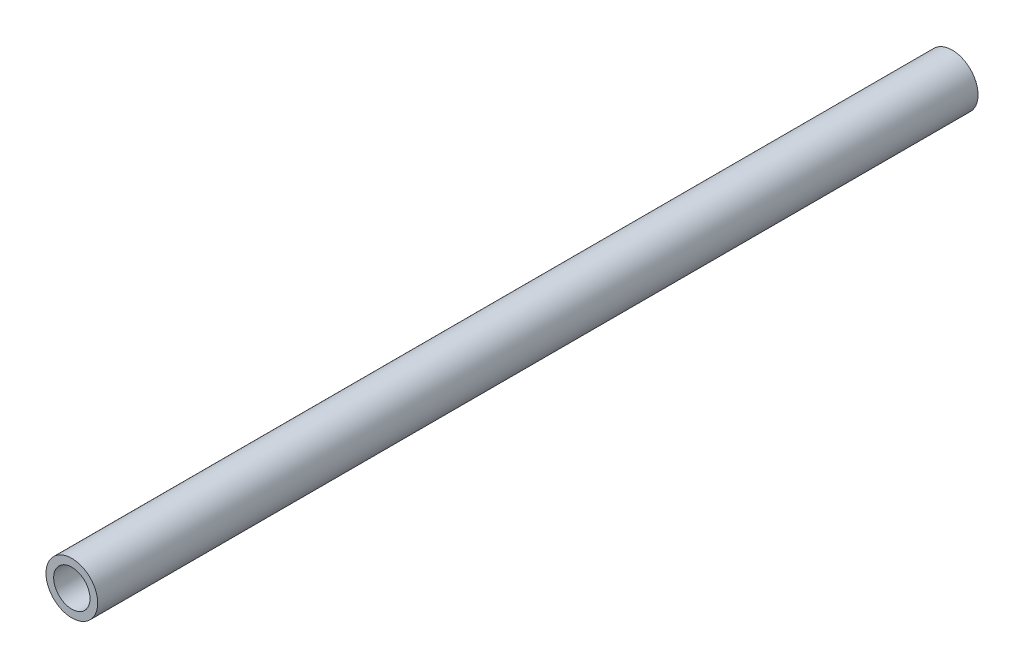
ISO-10303-21;
HEADER;
FILE_DESCRIPTION(('STEP AP214'),'2;1');
FILE_NAME('part.step','',(''),(''),'','','');
FILE_SCHEMA(('AUTOMOTIVE_DESIGN { 1 0 10303 214 1 1 1 1 }'));
ENDSEC;
DATA;
#1=APPLICATION_CONTEXT('core data for automotive mechanical design processes');
#2=APPLICATION_PROTOCOL_DEFINITION('international standard','automotive_design',2000,#1);
#3=PRODUCT_CONTEXT('',#1,'mechanical');
#4=PRODUCT('Part','Part','',(#3));
#5=PRODUCT_RELATED_PRODUCT_CATEGORY('part','',(#4));
#6=PRODUCT_DEFINITION_FORMATION('','',#4);
#7=PRODUCT_DEFINITION_CONTEXT('part definition',#1,'design');
#8=PRODUCT_DEFINITION('design','',#6,#7);
#9=PRODUCT_DEFINITION_SHAPE('','',#8);
#10=(LENGTH_UNIT() NAMED_UNIT(*) SI_UNIT(.MILLI.,.METRE.));
#11=(NAMED_UNIT(*) PLANE_ANGLE_UNIT() SI_UNIT($,.RADIAN.));
#12=(NAMED_UNIT(*) SI_UNIT($,.STERADIAN.) SOLID_ANGLE_UNIT());
#13=UNCERTAINTY_MEASURE_WITH_UNIT(LENGTH_MEASURE(1.E-05),#10,'distance_accuracy_value','');
#14=(GEOMETRIC_REPRESENTATION_CONTEXT(3) GLOBAL_UNCERTAINTY_ASSIGNED_CONTEXT((#13)) GLOBAL_UNIT_ASSIGNED_CONTEXT((#10,
#11,#12)) REPRESENTATION_CONTEXT('',''));
#15=CARTESIAN_POINT('',(0.,0.,0.));
#16=DIRECTION('',(0.,0.,1.));
#17=DIRECTION('',(1.,0.,0.));
#18=AXIS2_PLACEMENT_3D('',#15,#16,#17);
#19=CARTESIAN_POINT('',(347.5,-19.9999999999998,498.183766184074));
#20=DIRECTION('',(0.,0.,-1.));
#21=DIRECTION('',(-1.,0.,0.));
#22=AXIS2_PLACEMENT_3D('',#19,#20,#21);
#23=CYLINDRICAL_SURFACE('',#22,9.50000000000001);
#24=CARTESIAN_POINT('',(347.5,-19.9999999999998,0.));
#25=DIRECTION('',(0.,0.,-1.));
#26=DIRECTION('',(-1.,0.,0.));
#27=AXIS2_PLACEMENT_3D('',#24,#25,#26);
#28=CIRCLE('',#27,9.50000000000001);
#29=CARTESIAN_POINT('',(338.,-19.9999999999998,0.));
#30=VERTEX_POINT('',#29);
#31=EDGE_CURVE('E26',#30,#30,#28,.T.);
#32=ORIENTED_EDGE('',*,*,#31,.T.);
#33=EDGE_LOOP('',(#32));
#34=FACE_BOUND('',#33,.T.);
#35=CARTESIAN_POINT('',(347.5,-19.9999999999998,460.));
#36=DIRECTION('',(0.,0.,-1.));
#37=DIRECTION('',(-1.,0.,0.));
#38=AXIS2_PLACEMENT_3D('',#35,#36,#37);
#39=CIRCLE('',#38,9.50000000000001);
#40=CARTESIAN_POINT('',(338.,-19.9999999999998,460.));
#41=VERTEX_POINT('',#40);
#42=EDGE_CURVE('E17',#41,#41,#39,.T.);
#43=ORIENTED_EDGE('',*,*,#42,.F.);
#44=EDGE_LOOP('',(#43));
#45=FACE_BOUND('',#44,.T.);
#46=ADVANCED_FACE('F14',(#34,#45),#23,.F.);
#47=CARTESIAN_POINT('',(0.,-40.,460.));
#48=DIRECTION('',(0.,0.,1.));
#49=DIRECTION('',(1.,0.,0.));
#50=AXIS2_PLACEMENT_3D('',#47,#48,#49);
#51=PLANE('',#50);
#52=CARTESIAN_POINT('',(347.5,-19.9999999999998,460.));
#53=DIRECTION('',(0.,0.,-1.));
#54=DIRECTION('',(-1.,0.,0.));
#55=AXIS2_PLACEMENT_3D('',#52,#53,#54);
#56=CIRCLE('',#55,13.5);
#57=CARTESIAN_POINT('',(334.,-19.9999999999998,460.));
#58=VERTEX_POINT('',#57);
#59=EDGE_CURVE('E21',#58,#58,#56,.T.);
#60=ORIENTED_EDGE('',*,*,#59,.F.);
#61=EDGE_LOOP('',(#60));
#62=FACE_BOUND('',#61,.T.);
#63=ORIENTED_EDGE('',*,*,#42,.T.);
#64=EDGE_LOOP('',(#63));
#65=FACE_BOUND('',#64,.T.);
#66=ADVANCED_FACE('F34',(#62,#65),#51,.T.);
#67=CARTESIAN_POINT('',(347.5,-19.9999999999998,0.));
#68=DIRECTION('',(0.,0.,1.));
#69=DIRECTION('',(1.,0.,0.));
#70=AXIS2_PLACEMENT_3D('',#67,#68,#69);
#71=PLANE('',#70);
#72=ORIENTED_EDGE('',*,*,#31,.F.);
#73=EDGE_LOOP('',(#72));
#74=FACE_BOUND('',#73,.T.);
#75=CARTESIAN_POINT('',(347.5,-19.9999999999998,0.));
#76=DIRECTION('',(0.,0.,-1.));
#77=DIRECTION('',(-1.,0.,0.));
#78=AXIS2_PLACEMENT_3D('',#75,#76,#77);
#79=CIRCLE('',#78,13.5);
#80=CARTESIAN_POINT('',(334.,-19.9999999999998,0.));
#81=VERTEX_POINT('',#80);
#82=EDGE_CURVE('E10',#81,#81,#79,.F.);
#83=ORIENTED_EDGE('',*,*,#82,.F.);
#84=EDGE_LOOP('',(#83));
#85=FACE_BOUND('',#84,.T.);
#86=ADVANCED_FACE('F41',(#74,#85),#71,.F.);
#87=CARTESIAN_POINT('',(347.5,-19.9999999999998,498.183766184074));
#88=DIRECTION('',(0.,0.,-1.));
#89=DIRECTION('',(-1.,0.,0.));
#90=AXIS2_PLACEMENT_3D('',#87,#88,#89);
#91=CYLINDRICAL_SURFACE('',#90,13.5);
#92=ORIENTED_EDGE('',*,*,#82,.T.);
#93=EDGE_LOOP('',(#92));
#94=FACE_BOUND('',#93,.T.);
#95=ORIENTED_EDGE('',*,*,#59,.T.);
#96=EDGE_LOOP('',(#95));
#97=FACE_BOUND('',#96,.T.);
#98=ADVANCED_FACE('F43',(#94,#97),#91,.T.);
#99=CLOSED_SHELL('',(#46,#66,#86,#98));
#100=MANIFOLD_SOLID_BREP('B1',#99);
#101=ADVANCED_BREP_SHAPE_REPRESENTATION('',(#18,#100),#14);
#102=SHAPE_DEFINITION_REPRESENTATION(#9,#101);
ENDSEC;
END-ISO-10303-21;
